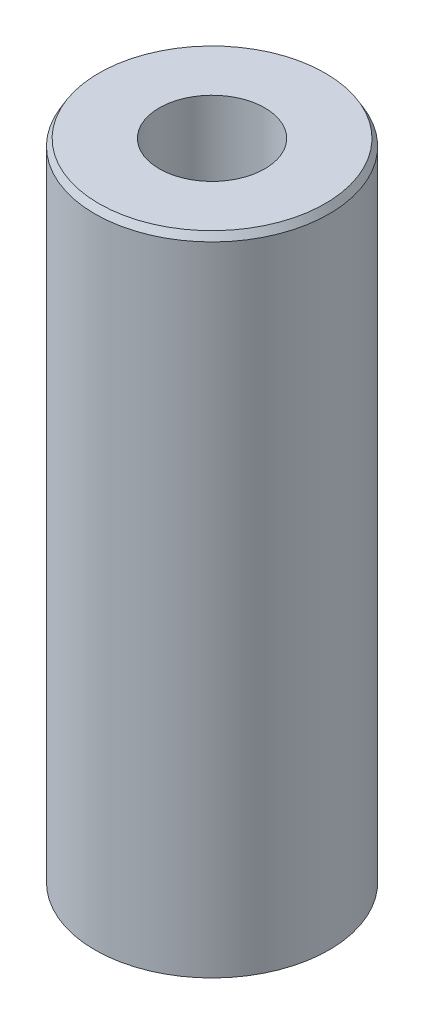
ISO-10303-21;
HEADER;
FILE_DESCRIPTION(('STEP AP214'),'2;1');
FILE_NAME('part.step','',(''),(''),'','','');
FILE_SCHEMA(('AUTOMOTIVE_DESIGN { 1 0 10303 214 1 1 1 1 }'));
ENDSEC;
DATA;
#1=APPLICATION_CONTEXT('core data for automotive mechanical design processes');
#2=APPLICATION_PROTOCOL_DEFINITION('international standard','automotive_design',2000,#1);
#3=PRODUCT_CONTEXT('',#1,'mechanical');
#4=PRODUCT('Part','Part','',(#3));
#5=PRODUCT_RELATED_PRODUCT_CATEGORY('part','',(#4));
#6=PRODUCT_DEFINITION_FORMATION('','',#4);
#7=PRODUCT_DEFINITION_CONTEXT('part definition',#1,'design');
#8=PRODUCT_DEFINITION('design','',#6,#7);
#9=PRODUCT_DEFINITION_SHAPE('','',#8);
#10=(LENGTH_UNIT() NAMED_UNIT(*) SI_UNIT(.MILLI.,.METRE.));
#11=(NAMED_UNIT(*) PLANE_ANGLE_UNIT() SI_UNIT($,.RADIAN.));
#12=(NAMED_UNIT(*) SI_UNIT($,.STERADIAN.) SOLID_ANGLE_UNIT());
#13=UNCERTAINTY_MEASURE_WITH_UNIT(LENGTH_MEASURE(1.E-05),#10,'distance_accuracy_value','');
#14=(GEOMETRIC_REPRESENTATION_CONTEXT(3) GLOBAL_UNCERTAINTY_ASSIGNED_CONTEXT((#13)) GLOBAL_UNIT_ASSIGNED_CONTEXT((#10,
#11,#12)) REPRESENTATION_CONTEXT('',''));
#15=CARTESIAN_POINT('',(0.,0.,0.));
#16=DIRECTION('',(0.,0.,1.));
#17=DIRECTION('',(1.,0.,0.));
#18=AXIS2_PLACEMENT_3D('',#15,#16,#17);
#19=CARTESIAN_POINT('',(0.,318.297930585561,0.));
#20=DIRECTION('',(0.,-1.,0.));
#21=DIRECTION('',(0.,0.,-1.));
#22=AXIS2_PLACEMENT_3D('',#19,#20,#21);
#23=CYLINDRICAL_SURFACE('',#22,57.5);
#24=CARTESIAN_POINT('',(0.,314.895382614662,0.));
#25=DIRECTION('',(0.,1.,0.));
#26=DIRECTION('',(0.,0.,1.));
#27=AXIS2_PLACEMENT_3D('',#24,#25,#26);
#28=CIRCLE('',#27,57.5);
#29=CARTESIAN_POINT('',(0.,314.895382614662,57.5));
#30=VERTEX_POINT('',#29);
#31=EDGE_CURVE('E50',#30,#30,#28,.F.);
#32=ORIENTED_EDGE('',*,*,#31,.T.);
#33=EDGE_LOOP('',(#32));
#34=FACE_BOUND('',#33,.T.);
#35=CARTESIAN_POINT('',(0.,1.96446198692873,0.));
#36=DIRECTION('',(0.,1.,0.));
#37=DIRECTION('',(0.,0.,1.));
#38=AXIS2_PLACEMENT_3D('',#35,#36,#37);
#39=CIRCLE('',#38,57.5);
#40=CARTESIAN_POINT('',(0.,1.96446198692873,57.5));
#41=VERTEX_POINT('',#40);
#42=EDGE_CURVE('E51',#41,#41,#39,.T.);
#43=ORIENTED_EDGE('',*,*,#42,.T.);
#44=EDGE_LOOP('',(#43));
#45=FACE_BOUND('',#44,.T.);
#46=ADVANCED_FACE('F39',(#34,#45),#23,.T.);
#47=CARTESIAN_POINT('',(0.,318.297930585561,0.));
#48=DIRECTION('',(0.,1.,0.));
#49=DIRECTION('',(0.,0.,1.));
#50=AXIS2_PLACEMENT_3D('',#47,#48,#49);
#51=PLANE('',#50);
#52=CARTESIAN_POINT('',(0.,318.297930585561,0.));
#53=DIRECTION('',(0.,1.,0.));
#54=DIRECTION('',(0.,0.,1.));
#55=AXIS2_PLACEMENT_3D('',#52,#53,#54);
#56=CIRCLE('',#55,55.5355380130712);
#57=CARTESIAN_POINT('',(0.,318.297930585561,55.5355380130712));
#58=VERTEX_POINT('',#57);
#59=EDGE_CURVE('E54',#58,#58,#56,.T.);
#60=ORIENTED_EDGE('',*,*,#59,.T.);
#61=EDGE_LOOP('',(#60));
#62=FACE_BOUND('',#61,.T.);
#63=CARTESIAN_POINT('',(0.,318.297930585561,0.));
#64=DIRECTION('',(0.,1.,0.));
#65=DIRECTION('',(0.,0.,1.));
#66=AXIS2_PLACEMENT_3D('',#63,#64,#65);
#67=CIRCLE('',#66,25.9283359758213);
#68=CARTESIAN_POINT('',(0.,318.297930585561,25.9283359758213));
#69=VERTEX_POINT('',#68);
#70=EDGE_CURVE('E58',#69,#69,#67,.T.);
#71=ORIENTED_EDGE('',*,*,#70,.F.);
#72=EDGE_LOOP('',(#71));
#73=FACE_BOUND('',#72,.T.);
#74=ADVANCED_FACE('F69',(#62,#73),#51,.T.);
#75=CARTESIAN_POINT('',(0.,0.,0.));
#76=DIRECTION('',(0.,1.,0.));
#77=DIRECTION('',(0.,0.,1.));
#78=AXIS2_PLACEMENT_3D('',#75,#76,#77);
#79=PLANE('',#78);
#80=CARTESIAN_POINT('',(0.,0.,0.));
#81=DIRECTION('',(0.,1.,0.));
#82=DIRECTION('',(0.,0.,1.));
#83=AXIS2_PLACEMENT_3D('',#80,#81,#82);
#84=CIRCLE('',#83,54.0974520291017);
#85=CARTESIAN_POINT('',(0.,0.,54.0974520291017));
#86=VERTEX_POINT('',#85);
#87=EDGE_CURVE('E10',#86,#86,#84,.F.);
#88=ORIENTED_EDGE('',*,*,#87,.T.);
#89=EDGE_LOOP('',(#88));
#90=FACE_BOUND('',#89,.T.);
#91=CARTESIAN_POINT('',(0.,0.,0.));
#92=DIRECTION('',(0.,1.,0.));
#93=DIRECTION('',(0.,0.,1.));
#94=AXIS2_PLACEMENT_3D('',#91,#92,#93);
#95=CIRCLE('',#94,25.9283359758213);
#96=CARTESIAN_POINT('',(0.,0.,25.9283359758213));
#97=VERTEX_POINT('',#96);
#98=EDGE_CURVE('E63',#97,#97,#95,.T.);
#99=ORIENTED_EDGE('',*,*,#98,.T.);
#100=EDGE_LOOP('',(#99));
#101=FACE_BOUND('',#100,.T.);
#102=ADVANCED_FACE('F75',(#90,#101),#79,.F.);
#103=CARTESIAN_POINT('',(0.,318.297930585561,0.));
#104=DIRECTION('',(0.,-1.,0.));
#105=DIRECTION('',(0.,0.,-1.));
#106=AXIS2_PLACEMENT_3D('',#103,#104,#105);
#107=CYLINDRICAL_SURFACE('',#106,25.9283359758213);
#108=ORIENTED_EDGE('',*,*,#70,.T.);
#109=EDGE_LOOP('',(#108));
#110=FACE_BOUND('',#109,.T.);
#111=ORIENTED_EDGE('',*,*,#98,.F.);
#112=EDGE_LOOP('',(#111));
#113=FACE_BOUND('',#112,.T.);
#114=ADVANCED_FACE('F70',(#110,#113),#107,.F.);
#115=CARTESIAN_POINT('',(0.,318.297930585561,0.));
#116=DIRECTION('',(0.,-1.,0.));
#117=DIRECTION('',(0.,0.,-1.));
#118=AXIS2_PLACEMENT_3D('',#115,#116,#117);
#119=CONICAL_SURFACE('',#118,55.5355380130712,0.52359877559829);
#120=ORIENTED_EDGE('',*,*,#31,.F.);
#121=EDGE_LOOP('',(#120));
#122=FACE_BOUND('',#121,.T.);
#123=ORIENTED_EDGE('',*,*,#59,.F.);
#124=EDGE_LOOP('',(#123));
#125=FACE_BOUND('',#124,.T.);
#126=ADVANCED_FACE('F81',(#122,#125),#119,.T.);
#127=CARTESIAN_POINT('',(0.,1.96446198692873,0.));
#128=DIRECTION('',(0.,1.,0.));
#129=DIRECTION('',(0.,0.,1.));
#130=AXIS2_PLACEMENT_3D('',#127,#128,#129);
#131=CONICAL_SURFACE('',#130,57.5,1.0471975511966);
#132=ORIENTED_EDGE('',*,*,#87,.F.);
#133=EDGE_LOOP('',(#132));
#134=FACE_BOUND('',#133,.T.);
#135=ORIENTED_EDGE('',*,*,#42,.F.);
#136=EDGE_LOOP('',(#135));
#137=FACE_BOUND('',#136,.T.);
#138=ADVANCED_FACE('F45',(#134,#137),#131,.T.);
#139=CLOSED_SHELL('',(#46,#74,#102,#114,#126,#138));
#140=MANIFOLD_SOLID_BREP('B2',#139);
#141=ADVANCED_BREP_SHAPE_REPRESENTATION('',(#18,#140),#14);
#142=SHAPE_DEFINITION_REPRESENTATION(#9,#141);
ENDSEC;
END-ISO-10303-21;
